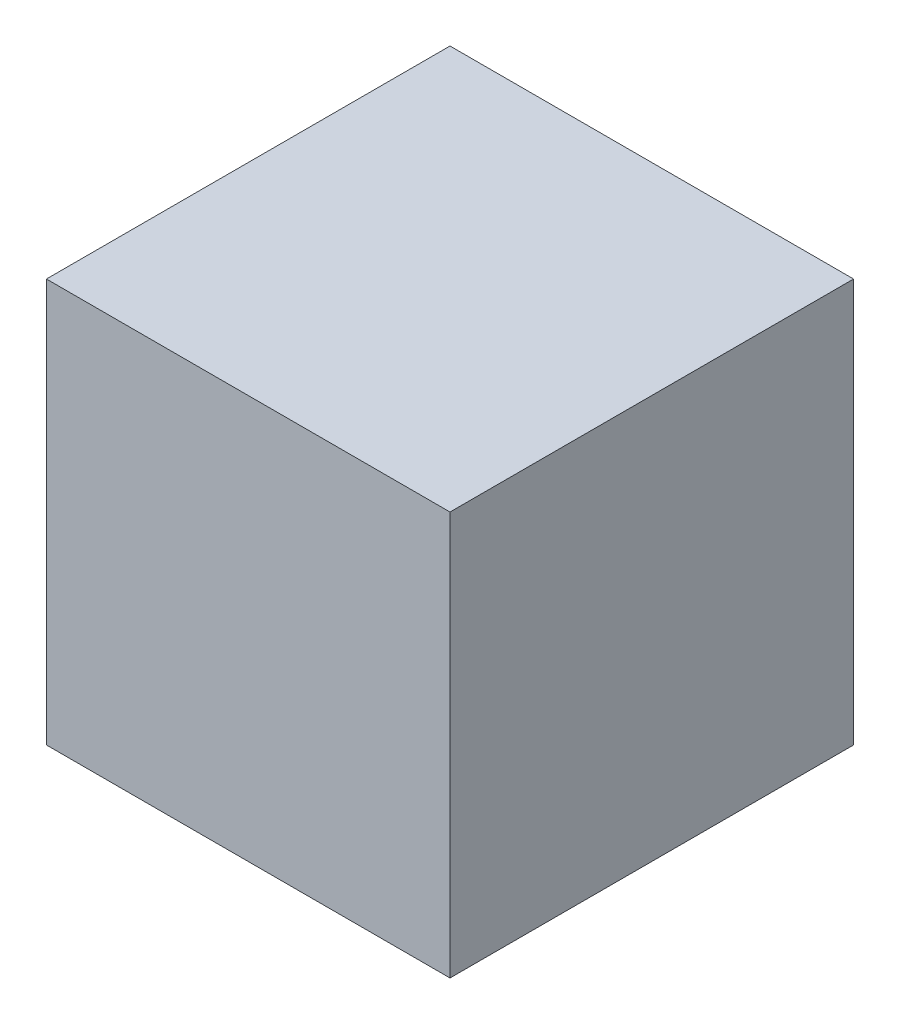
ISO-10303-21;
HEADER;
FILE_DESCRIPTION(('STEP AP214'),'2;1');
FILE_NAME('part.step','',(''),(''),'','','');
FILE_SCHEMA(('AUTOMOTIVE_DESIGN { 1 0 10303 214 1 1 1 1 }'));
ENDSEC;
DATA;
#1=APPLICATION_CONTEXT('core data for automotive mechanical design processes');
#2=APPLICATION_PROTOCOL_DEFINITION('international standard','automotive_design',2000,#1);
#3=PRODUCT_CONTEXT('',#1,'mechanical');
#4=PRODUCT('Part','Part','',(#3));
#5=PRODUCT_RELATED_PRODUCT_CATEGORY('part','',(#4));
#6=PRODUCT_DEFINITION_FORMATION('','',#4);
#7=PRODUCT_DEFINITION_CONTEXT('part definition',#1,'design');
#8=PRODUCT_DEFINITION('design','',#6,#7);
#9=PRODUCT_DEFINITION_SHAPE('','',#8);
#10=(LENGTH_UNIT() NAMED_UNIT(*) SI_UNIT(.MILLI.,.METRE.));
#11=(NAMED_UNIT(*) PLANE_ANGLE_UNIT() SI_UNIT($,.RADIAN.));
#12=(NAMED_UNIT(*) SI_UNIT($,.STERADIAN.) SOLID_ANGLE_UNIT());
#13=UNCERTAINTY_MEASURE_WITH_UNIT(LENGTH_MEASURE(1.E-05),#10,'distance_accuracy_value','');
#14=(GEOMETRIC_REPRESENTATION_CONTEXT(3) GLOBAL_UNCERTAINTY_ASSIGNED_CONTEXT((#13)) GLOBAL_UNIT_ASSIGNED_CONTEXT((#10,
#11,#12)) REPRESENTATION_CONTEXT('',''));
#15=CARTESIAN_POINT('',(0.,0.,0.));
#16=DIRECTION('',(0.,0.,1.));
#17=DIRECTION('',(1.,0.,0.));
#18=AXIS2_PLACEMENT_3D('',#15,#16,#17);
#19=CARTESIAN_POINT('',(50.,50.,100.));
#20=DIRECTION('',(-1.,0.,0.));
#21=DIRECTION('',(0.,0.,1.));
#22=AXIS2_PLACEMENT_3D('',#19,#20,#21);
#23=PLANE('',#22);
#24=DIRECTION('',(0.,1.,0.));
#25=VECTOR('',#24,1.);
#26=CARTESIAN_POINT('',(50.,50.,0.));
#27=LINE('',#26,#25);
#28=CARTESIAN_POINT('',(50.,-50.,0.));
#29=VERTEX_POINT('',#28);
#30=CARTESIAN_POINT('',(50.,50.,0.));
#31=VERTEX_POINT('',#30);
#32=EDGE_CURVE('E107',#29,#31,#27,.T.);
#33=ORIENTED_EDGE('',*,*,#32,.T.);
#34=DIRECTION('',(0.,0.,-1.));
#35=VECTOR('',#34,1.);
#36=CARTESIAN_POINT('',(50.,50.,100.));
#37=LINE('',#36,#35);
#38=CARTESIAN_POINT('',(50.,50.,100.));
#39=VERTEX_POINT('',#38);
#40=EDGE_CURVE('E11',#39,#31,#37,.T.);
#41=ORIENTED_EDGE('',*,*,#40,.F.);
#42=DIRECTION('',(0.,1.,0.));
#43=VECTOR('',#42,1.);
#44=CARTESIAN_POINT('',(50.,50.,100.));
#45=LINE('',#44,#43);
#46=CARTESIAN_POINT('',(50.,-50.,100.));
#47=VERTEX_POINT('',#46);
#48=EDGE_CURVE('E91',#47,#39,#45,.T.);
#49=ORIENTED_EDGE('',*,*,#48,.F.);
#50=DIRECTION('',(0.,0.,-1.));
#51=VECTOR('',#50,1.);
#52=CARTESIAN_POINT('',(50.,-50.,100.));
#53=LINE('',#52,#51);
#54=EDGE_CURVE('E103',#47,#29,#53,.T.);
#55=ORIENTED_EDGE('',*,*,#54,.T.);
#56=EDGE_LOOP('',(#33,#41,#49,#55));
#57=FACE_BOUND('',#56,.T.);
#58=ADVANCED_FACE('F39',(#57),#23,.F.);
#59=CARTESIAN_POINT('',(-50.,50.,100.));
#60=DIRECTION('',(0.,-1.,0.));
#61=DIRECTION('',(0.,0.,-1.));
#62=AXIS2_PLACEMENT_3D('',#59,#60,#61);
#63=PLANE('',#62);
#64=DIRECTION('',(-1.,0.,0.));
#65=VECTOR('',#64,1.);
#66=CARTESIAN_POINT('',(-50.,50.,0.));
#67=LINE('',#66,#65);
#68=CARTESIAN_POINT('',(-50.,50.,0.));
#69=VERTEX_POINT('',#68);
#70=EDGE_CURVE('E96',#31,#69,#67,.T.);
#71=ORIENTED_EDGE('',*,*,#70,.T.);
#72=DIRECTION('',(0.,0.,-1.));
#73=VECTOR('',#72,1.);
#74=CARTESIAN_POINT('',(-50.,50.,100.));
#75=LINE('',#74,#73);
#76=CARTESIAN_POINT('',(-50.,50.,100.));
#77=VERTEX_POINT('',#76);
#78=EDGE_CURVE('E48',#77,#69,#75,.T.);
#79=ORIENTED_EDGE('',*,*,#78,.F.);
#80=DIRECTION('',(-1.,0.,0.));
#81=VECTOR('',#80,1.);
#82=CARTESIAN_POINT('',(-50.,50.,100.));
#83=LINE('',#82,#81);
#84=EDGE_CURVE('E86',#39,#77,#83,.T.);
#85=ORIENTED_EDGE('',*,*,#84,.F.);
#86=ORIENTED_EDGE('',*,*,#40,.T.);
#87=EDGE_LOOP('',(#71,#79,#85,#86));
#88=FACE_BOUND('',#87,.T.);
#89=ADVANCED_FACE('F95',(#88),#63,.F.);
#90=CARTESIAN_POINT('',(-50.,50.,100.));
#91=DIRECTION('',(1.,0.,0.));
#92=DIRECTION('',(0.,0.,-1.));
#93=AXIS2_PLACEMENT_3D('',#90,#91,#92);
#94=PLANE('',#93);
#95=DIRECTION('',(0.,-1.,0.));
#96=VECTOR('',#95,1.);
#97=CARTESIAN_POINT('',(-50.,50.,0.));
#98=LINE('',#97,#96);
#99=CARTESIAN_POINT('',(-50.,-50.,0.));
#100=VERTEX_POINT('',#99);
#101=EDGE_CURVE('E73',#69,#100,#98,.T.);
#102=ORIENTED_EDGE('',*,*,#101,.T.);
#103=DIRECTION('',(0.,0.,-1.));
#104=VECTOR('',#103,1.);
#105=CARTESIAN_POINT('',(-50.,-50.,100.));
#106=LINE('',#105,#104);
#107=CARTESIAN_POINT('',(-50.,-50.,100.));
#108=VERTEX_POINT('',#107);
#109=EDGE_CURVE('E98',#108,#100,#106,.T.);
#110=ORIENTED_EDGE('',*,*,#109,.F.);
#111=DIRECTION('',(0.,-1.,0.));
#112=VECTOR('',#111,1.);
#113=CARTESIAN_POINT('',(-50.,50.,100.));
#114=LINE('',#113,#112);
#115=EDGE_CURVE('E89',#77,#108,#114,.T.);
#116=ORIENTED_EDGE('',*,*,#115,.F.);
#117=ORIENTED_EDGE('',*,*,#78,.T.);
#118=EDGE_LOOP('',(#102,#110,#116,#117));
#119=FACE_BOUND('',#118,.T.);
#120=ADVANCED_FACE('F99',(#119),#94,.F.);
#121=CARTESIAN_POINT('',(-50.,-50.,100.));
#122=DIRECTION('',(0.,1.,0.));
#123=DIRECTION('',(0.,0.,1.));
#124=AXIS2_PLACEMENT_3D('',#121,#122,#123);
#125=PLANE('',#124);
#126=DIRECTION('',(1.,0.,0.));
#127=VECTOR('',#126,1.);
#128=CARTESIAN_POINT('',(-50.,-50.,0.));
#129=LINE('',#128,#127);
#130=EDGE_CURVE('E79',#100,#29,#129,.T.);
#131=ORIENTED_EDGE('',*,*,#130,.T.);
#132=ORIENTED_EDGE('',*,*,#54,.F.);
#133=DIRECTION('',(1.,0.,0.));
#134=VECTOR('',#133,1.);
#135=CARTESIAN_POINT('',(-50.,-50.,100.));
#136=LINE('',#135,#134);
#137=EDGE_CURVE('E56',#108,#47,#136,.T.);
#138=ORIENTED_EDGE('',*,*,#137,.F.);
#139=ORIENTED_EDGE('',*,*,#109,.T.);
#140=EDGE_LOOP('',(#131,#132,#138,#139));
#141=FACE_BOUND('',#140,.T.);
#142=ADVANCED_FACE('F120',(#141),#125,.F.);
#143=CARTESIAN_POINT('',(0.,0.,100.));
#144=DIRECTION('',(0.,0.,1.));
#145=DIRECTION('',(1.,0.,0.));
#146=AXIS2_PLACEMENT_3D('',#143,#144,#145);
#147=PLANE('',#146);
#148=ORIENTED_EDGE('',*,*,#48,.T.);
#149=ORIENTED_EDGE('',*,*,#84,.T.);
#150=ORIENTED_EDGE('',*,*,#115,.T.);
#151=ORIENTED_EDGE('',*,*,#137,.T.);
#152=EDGE_LOOP('',(#148,#149,#150,#151));
#153=FACE_BOUND('',#152,.T.);
#154=ADVANCED_FACE('F87',(#153),#147,.T.);
#155=CARTESIAN_POINT('',(0.,0.,0.));
#156=DIRECTION('',(0.,0.,1.));
#157=DIRECTION('',(1.,0.,0.));
#158=AXIS2_PLACEMENT_3D('',#155,#156,#157);
#159=PLANE('',#158);
#160=ORIENTED_EDGE('',*,*,#32,.F.);
#161=ORIENTED_EDGE('',*,*,#130,.F.);
#162=ORIENTED_EDGE('',*,*,#101,.F.);
#163=ORIENTED_EDGE('',*,*,#70,.F.);
#164=EDGE_LOOP('',(#160,#161,#162,#163));
#165=FACE_BOUND('',#164,.T.);
#166=ADVANCED_FACE('F123',(#165),#159,.F.);
#167=CLOSED_SHELL('',(#58,#89,#120,#142,#154,#166));
#168=MANIFOLD_SOLID_BREP('B2',#167);
#169=ADVANCED_BREP_SHAPE_REPRESENTATION('',(#18,#168),#14);
#170=SHAPE_DEFINITION_REPRESENTATION(#9,#169);
ENDSEC;
END-ISO-10303-21;
